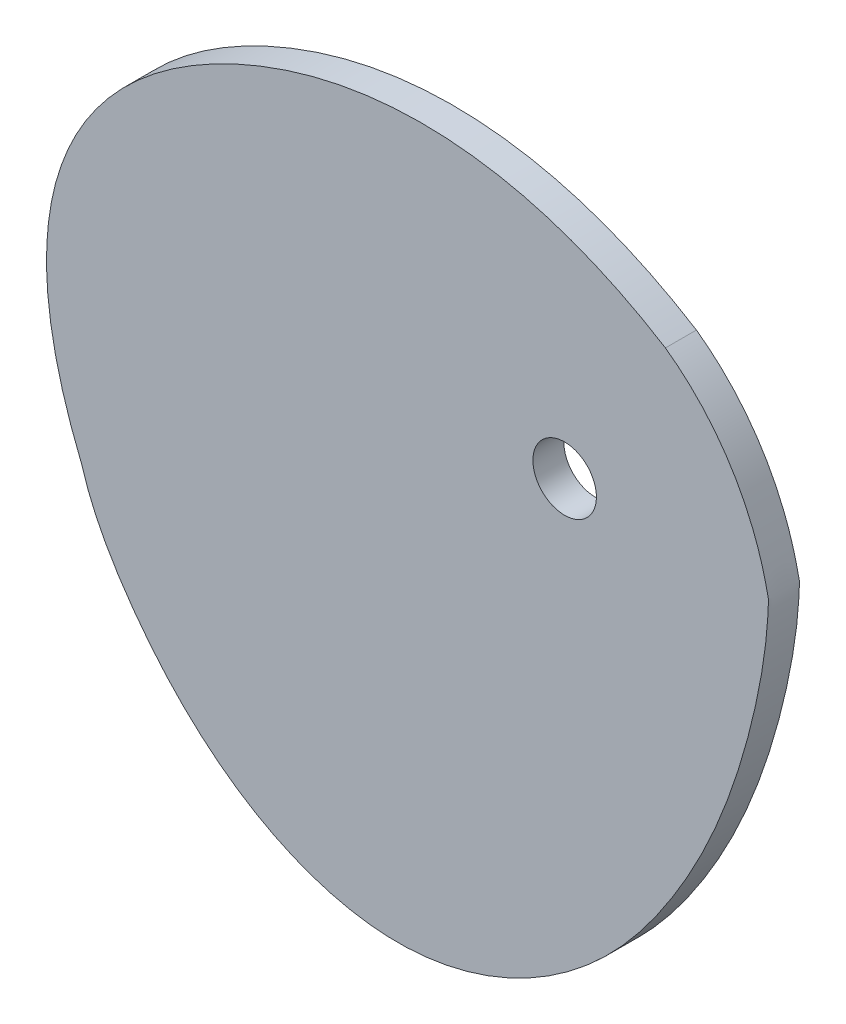
ISO-10303-21;
HEADER;
FILE_DESCRIPTION(('STEP AP214'),'2;1');
FILE_NAME('part.step','',(''),(''),'','','');
FILE_SCHEMA(('AUTOMOTIVE_DESIGN { 1 0 10303 214 1 1 1 1 }'));
ENDSEC;
DATA;
#1=APPLICATION_CONTEXT('core data for automotive mechanical design processes');
#2=APPLICATION_PROTOCOL_DEFINITION('international standard','automotive_design',2000,#1);
#3=PRODUCT_CONTEXT('',#1,'mechanical');
#4=PRODUCT('Part','Part','',(#3));
#5=PRODUCT_RELATED_PRODUCT_CATEGORY('part','',(#4));
#6=PRODUCT_DEFINITION_FORMATION('','',#4);
#7=PRODUCT_DEFINITION_CONTEXT('part definition',#1,'design');
#8=PRODUCT_DEFINITION('design','',#6,#7);
#9=PRODUCT_DEFINITION_SHAPE('','',#8);
#10=(LENGTH_UNIT() NAMED_UNIT(*) SI_UNIT(.MILLI.,.METRE.));
#11=(NAMED_UNIT(*) PLANE_ANGLE_UNIT() SI_UNIT($,.RADIAN.));
#12=(NAMED_UNIT(*) SI_UNIT($,.STERADIAN.) SOLID_ANGLE_UNIT());
#13=UNCERTAINTY_MEASURE_WITH_UNIT(LENGTH_MEASURE(1.E-05),#10,'distance_accuracy_value','');
#14=(GEOMETRIC_REPRESENTATION_CONTEXT(3) GLOBAL_UNCERTAINTY_ASSIGNED_CONTEXT((#13)) GLOBAL_UNIT_ASSIGNED_CONTEXT((#10,
#11,#12)) REPRESENTATION_CONTEXT('',''));
#15=CARTESIAN_POINT('',(0.,0.,0.));
#16=DIRECTION('',(0.,0.,1.));
#17=DIRECTION('',(1.,0.,0.));
#18=AXIS2_PLACEMENT_3D('',#15,#16,#17);
#19=CARTESIAN_POINT('',(2.83016154706759,-39.1014845749319,1.5));
#20=DIRECTION('',(0.,0.,-1.));
#21=DIRECTION('',(-1.,0.,0.));
#22=AXIS2_PLACEMENT_3D('',#19,#20,#21);
#23=PLANE('',#22);
#24=CARTESIAN_POINT('',(-46.7200267733043,-22.204755219371,1.5));
#25=CARTESIAN_POINT('',(-46.6806896431284,-22.339756210772,1.5));
#26=CARTESIAN_POINT('',(-46.5523371878223,-22.7653201294335,1.5));
#27=CARTESIAN_POINT('',(-46.3155303346492,-23.4752196796211,1.5));
#28=CARTESIAN_POINT('',(-45.9947243960051,-24.3283543042865,1.5));
#29=CARTESIAN_POINT('',(-45.6437430297893,-25.1693811667558,1.5));
#30=CARTESIAN_POINT('',(-45.2646353329962,-25.9982013761393,1.5));
#31=CARTESIAN_POINT('',(-44.8594144038269,-26.8148407470711,1.5));
#32=CARTESIAN_POINT('',(-44.4300522960045,-27.6194476364059,1.5));
#33=CARTESIAN_POINT('',(-43.9784750669762,-28.4122906225906,1.5));
#34=CARTESIAN_POINT('',(-43.5065578480158,-29.1937561132233,1.5));
#35=CARTESIAN_POINT('',(-43.0161202134374,-29.9643455431097,1.5));
#36=CARTESIAN_POINT('',(-42.5089208310377,-30.7246734081901,1.5));
#37=CARTESIAN_POINT('',(-41.9866590298339,-31.4754559945261,1.5));
#38=CARTESIAN_POINT('',(-41.272178341668,-32.4651758723665,1.5));
#39=CARTESIAN_POINT('',(-40.5304955827092,-33.4359119257084,1.5));
#40=CARTESIAN_POINT('',(-39.7606544454638,-34.3852551358346,1.5));
#41=CARTESIAN_POINT('',(-39.1687146070949,-35.0862367763247,1.5));
#42=CARTESIAN_POINT('',(-38.5622378296788,-35.775277911029,1.5));
#43=CARTESIAN_POINT('',(-37.9411016548474,-36.4516616916267,1.5));
#44=CARTESIAN_POINT('',(-37.3052185953797,-37.1146504932271,1.5));
#45=CARTESIAN_POINT('',(-36.654537168951,-37.7634872776314,1.5));
#46=CARTESIAN_POINT('',(-35.9890428699015,-38.3973970131874,1.5));
#47=CARTESIAN_POINT('',(-35.3087590978328,-39.0155881247338,1.5));
#48=CARTESIAN_POINT('',(-34.6137480366145,-39.6172539788969,1.5));
#49=CARTESIAN_POINT('',(-33.9041114842077,-40.201574401452,1.5));
#50=CARTESIAN_POINT('',(-33.1799916319454,-40.7677172257195,1.5));
#51=CARTESIAN_POINT('',(-32.441571792439,-41.3148398703262,1.5));
#52=CARTESIAN_POINT('',(-31.6890770752126,-41.8420909448106,1.5));
#53=CARTESIAN_POINT('',(-30.9227750092429,-42.3486118814808,1.5));
#54=CARTESIAN_POINT('',(-30.1429761116329,-42.8335385919371,1.5));
#55=CARTESIAN_POINT('',(-29.3500344017037,-43.296003146648,1.5));
#56=CARTESIAN_POINT('',(-28.5443478598394,-43.7351354759695,1.5));
#57=CARTESIAN_POINT('',(-27.7263588304788,-44.1500650909847,1.5));
#58=CARTESIAN_POINT('',(-26.8965543686953,-44.5399228225483,1.5));
#59=CARTESIAN_POINT('',(-26.0554665298625,-44.9038425769291,1.5));
#60=CARTESIAN_POINT('',(-25.2036726019509,-45.2409631064121,1.5));
#61=CARTESIAN_POINT('',(-24.3417952800304,-45.5504297934193,1.5));
#62=CARTESIAN_POINT('',(-23.4705027826652,-45.8313964460331,1.5));
#63=CARTESIAN_POINT('',(-22.5905089096368,-46.0830271054362,1.5));
#64=CARTESIAN_POINT('',(-21.7025730415144,-46.3044978560701,1.5));
#65=CARTESIAN_POINT('',(-20.8075000776663,-46.4949986657037,1.5));
#66=CARTESIAN_POINT('',(-19.9061403239913,-46.6537351469297,1.5));
#67=CARTESIAN_POINT('',(-18.999389286865,-46.7799306381342,1.5));
#68=CARTESIAN_POINT('',(-18.0881875342416,-46.872827111094,1.5));
#69=CARTESIAN_POINT('',(-17.1735200212908,-46.9316904735896,1.5));
#70=CARTESIAN_POINT('',(-16.2564171300205,-46.95579945848,1.5));
#71=CARTESIAN_POINT('',(-15.3379622535156,-46.9444960185609,1.5));
#72=CARTESIAN_POINT('',(-14.4194164111454,-46.897014518559,1.5));
#73=CARTESIAN_POINT('',(-13.5021714584145,-46.8138702239532,1.5));
#74=CARTESIAN_POINT('',(-12.5876697193115,-46.6959005050609,1.5));
#75=CARTESIAN_POINT('',(-11.6773484463756,-46.5439280755594,1.5));
#76=CARTESIAN_POINT('',(-10.7725868435563,-46.3588455940353,1.5));
#77=CARTESIAN_POINT('',(-9.87470644315353,-46.1415892508581,1.5));
#78=CARTESIAN_POINT('',(-8.98496902317576,-45.8931426962907,1.5));
#79=CARTESIAN_POINT('',(-8.10457534959719,-45.6145327765504,1.5));
#80=CARTESIAN_POINT('',(-7.2346638064212,-45.3068274140633,1.5));
#81=CARTESIAN_POINT('',(-6.3763091668303,-44.9711328632358,1.5));
#82=CARTESIAN_POINT('',(-5.5305214393265,-44.608591087316,1.5));
#83=CARTESIAN_POINT('',(-4.69824480819538,-44.2203770601003,1.5));
#84=CARTESIAN_POINT('',(-3.88035666457306,-43.8076960486166,1.5));
#85=CARTESIAN_POINT('',(-3.0776667304062,-43.37178086539,1.5));
#86=CARTESIAN_POINT('',(-2.29091627583035,-42.9138890970096,1.5));
#87=CARTESIAN_POINT('',(-1.52077743081287,-42.4353003108935,1.5));
#88=CARTESIAN_POINT('',(-0.767852591678114,-41.9373132434567,1.5));
#89=CARTESIAN_POINT('',(-0.0326739230526381,-41.4212429725426,1.5));
#90=CARTESIAN_POINT('',(0.684297044342781,-40.8884180770757,1.5));
#91=CARTESIAN_POINT('',(1.38266971972998,-40.3401777868555,1.5));
#92=CARTESIAN_POINT('',(2.06212466191325,-39.7778691254187,1.5));
#93=CARTESIAN_POINT('',(2.72241369239813,-39.2028440488736,1.5));
#94=CARTESIAN_POINT('',(3.36335991195214,-38.6164565835916,1.5));
#95=CARTESIAN_POINT('',(3.98485762070806,-38.020059965646,1.5));
#96=CARTESIAN_POINT('',(4.586872141861,-37.4150037847611,1.5));
#97=CARTESIAN_POINT('',(5.16943954966292,-36.8026311358668,1.5));
#98=CARTESIAN_POINT('',(5.73266630049337,-36.1842757799967,1.5));
#99=CARTESIAN_POINT('',(6.27672877336092,-35.5612593210856,1.5));
#100=CARTESIAN_POINT('',(6.80187269890598,-34.9348883873418,1.5));
#101=CARTESIAN_POINT('',(7.30841255661586,-34.3064518712496,1.5));
#102=CARTESIAN_POINT('',(7.79673065185279,-33.677218042469,1.5));
#103=CARTESIAN_POINT('',(8.26727693226581,-33.0484322252843,1.5));
#104=CARTESIAN_POINT('',(8.72056567595092,-32.421312524385,1.5));
#105=CARTESIAN_POINT('',(9.15718317743708,-31.7970527967723,1.5));
#106=CARTESIAN_POINT('',(9.5777589868868,-31.1767933527587,1.5));
#107=CARTESIAN_POINT('',(9.98313875569843,-30.5616036586118,1.5));
#108=CARTESIAN_POINT('',(10.6231886493542,-29.5630834979464,1.5));
#109=CARTESIAN_POINT('',(11.3426803358376,-28.3774334310852,1.5));
#110=CARTESIAN_POINT('',(12.119739061767,-27.0057761937296,1.5));
#111=CARTESIAN_POINT('',(12.7314656691996,-25.8657241240726,1.5));
#112=CARTESIAN_POINT('',(13.2980841825559,-24.7513416832927,1.5));
#113=CARTESIAN_POINT('',(13.8228108285091,-23.6628164014472,1.5));
#114=CARTESIAN_POINT('',(14.3087349678902,-22.6001400263386,1.5));
#115=CARTESIAN_POINT('',(14.8296582699646,-21.3998792688078,1.5));
#116=CARTESIAN_POINT('',(15.3712592546028,-20.0692094499295,1.5));
#117=CARTESIAN_POINT('',(15.9765488862487,-18.4650261382676,1.5));
#118=CARTESIAN_POINT('',(16.5127479022829,-16.9161227755077,1.5));
#119=CARTESIAN_POINT('',(16.9889990250079,-15.4199072684742,1.5));
#120=CARTESIAN_POINT('',(17.3723711766362,-14.1276443238027,1.5));
#121=CARTESIAN_POINT('',(17.6819904604084,-13.0086975132311,1.5));
#122=CARTESIAN_POINT('',(17.9311319137297,-12.0542261205352,1.5));
#123=CARTESIAN_POINT('',(18.1299371945772,-11.2556683894719,1.5));
#124=CARTESIAN_POINT('',(18.3161042194094,-10.4706351131512,1.5));
#125=CARTESIAN_POINT('',(18.4903341603048,-9.69783279676552,1.5));
#126=CARTESIAN_POINT('',(18.6531653511248,-8.93598494781779,1.5));
#127=CARTESIAN_POINT('',(18.8049780391056,-8.18384415660625,1.5));
#128=CARTESIAN_POINT('',(18.9460001721467,-7.4402038132655,1.5));
#129=CARTESIAN_POINT('',(19.0763138608845,-6.7039093056558,1.5));
#130=CARTESIAN_POINT('',(19.1958625401379,-5.97386868347734,1.5));
#131=CARTESIAN_POINT('',(19.3044587766999,-5.24906274769108,1.5));
#132=CARTESIAN_POINT('',(19.4178297820653,-4.4098409416767,1.5));
#133=CARTESIAN_POINT('',(19.5007452350434,-3.69243330539014,1.5));
#134=CARTESIAN_POINT('',(19.5593862987678,-3.09619410738784,1.5));
#135=CARTESIAN_POINT('',(19.5912654879333,-2.73992761476211,1.5));
#136=CARTESIAN_POINT('',(19.6198641079612,-2.3841015002169,1.5));
#137=CARTESIAN_POINT('',(19.645033575195,-2.02865900018924,1.5));
#138=CARTESIAN_POINT('',(19.6668946186842,-1.67352574175937,1.5));
#139=CARTESIAN_POINT('',(19.6845438660083,-1.31872839859245,1.5));
#140=CARTESIAN_POINT('',(19.7008731789679,-0.963953499683479,1.5));
#141=CARTESIAN_POINT('',(19.7046150435928,-0.610191974523897,1.5));
#142=CARTESIAN_POINT('',(19.7375218092732,-0.250741843414967,1.5));
#143=CARTESIAN_POINT('',(19.6409542776031,0.0993515058348664,1.5));
#144=CARTESIAN_POINT('',(19.5735637612747,0.452939857720873,1.5));
#145=CARTESIAN_POINT('',(19.4929853708508,0.803041009068936,1.5));
#146=CARTESIAN_POINT('',(19.4107954229631,1.15063058023641,1.5));
#147=CARTESIAN_POINT('',(19.3239793087413,1.49545032526501,1.5));
#148=CARTESIAN_POINT('',(19.2334010369509,1.8375705156503,1.5));
#149=CARTESIAN_POINT('',(19.076564402052,2.40079796578955,1.5));
#150=CARTESIAN_POINT('',(18.7726190681371,3.3950521847464,1.5));
#151=CARTESIAN_POINT('',(18.3055669341586,4.68691012576585,1.5));
#152=CARTESIAN_POINT('',(17.72821517047,6.03840945781484,1.5));
#153=CARTESIAN_POINT('',(17.1412908397453,7.24029203362605,1.5));
#154=CARTESIAN_POINT('',(16.50091822728,8.39848799108871,1.5));
#155=CARTESIAN_POINT('',(15.8083165474384,9.51249777799579,1.5));
#156=CARTESIAN_POINT('',(15.0644935845586,10.5815610262602,1.5));
#157=CARTESIAN_POINT('',(14.2703075234825,11.6046262406065,1.5));
#158=CARTESIAN_POINT('',(13.4265325648609,12.5803316758525,1.5));
#159=CARTESIAN_POINT('',(12.5339253659798,13.5069949121125,1.5));
#160=CARTESIAN_POINT('',(11.5932917893056,14.3826119902024,1.5));
#161=CARTESIAN_POINT('',(10.6635953636642,15.1565474445866,1.5));
#162=CARTESIAN_POINT('',(10.0381787907559,15.6249748171961,1.5));
#163=CARTESIAN_POINT('',(9.7506524888649,15.8299518881213,1.5));
#164=B_SPLINE_CURVE_WITH_KNOTS('',3,(#24,#25,#26,#27,#28,#29,#30,#31,#32,#33,#34,#35,#36,#37,
#38,#39,#40,#41,#42,#43,#44,#45,#46,#47,#48,#49,#50,#51,#52,#53,#54,#55,#56,#57,#58,#59,#60,#61,
#62,#63,#64,#65,#66,#67,#68,#69,#70,#71,#72,#73,#74,#75,#76,#77,#78,#79,#80,#81,#82,#83,#84,#85,
#86,#87,#88,#89,#90,#91,#92,#93,#94,#95,#96,#97,#98,#99,#100,#101,#102,#103,#104,#105,#106,#107,
#108,#109,#110,#111,#112,#113,#114,#115,#116,#117,#118,#119,#120,#121,#122,#123,#124,#125,#126,
#127,#128,#129,#130,#131,#132,#133,#134,#135,#136,#137,#138,#139,#140,#141,#142,#143,#144,#145,
#146,#147,#148,#149,#150,#151,#152,#153,#154,#155,#156,#157,#158,#159,#160,#161,#162,#163),
.UNSPECIFIED.,.F.,.F.,(4,1,1,1,1,1,1,1,1,1,1,1,1,1,1,1,1,1,1,1,1,1,1,1,1,1,1,1,1,1,1,1,1,1,1,1,
1,1,1,1,1,1,1,1,1,1,1,1,1,1,1,1,1,1,1,1,1,1,1,1,1,1,1,1,1,1,1,1,1,1,1,1,1,1,1,1,1,1,1,1,1,1,1,1,
1,1,1,1,1,1,1,1,1,1,1,1,1,1,1,1,1,1,1,1,1,1,1,1,1,1,1,1,1,1,1,1,1,1,1,1,1,1,1,1,1,1,1,1,1,1,1,1,
1,1,1,1,1,4),(0.483675046873344,0.48572747967474,0.490162692570574,0.494596120850626,
0.499029125542321,0.503462729771966,0.507897674169671,0.512334472379887,0.516773466441591,
0.521214881902109,0.525658882604184,0.530105625137013,0.53455531296895,0.539008152916846,
0.547922899701876,0.552384416639101,0.556848379263364,0.561314514709037,0.565782527567126,
0.570252104668917,0.57472291987726,0.579194638894886,0.583666924099619,0.588139439416691,
0.592611855238536,0.597083853402432,0.601555132236205,0.606025411681864,0.610494438506485,
0.614961991608931,0.619427887429995,0.623891985472355,0.628354193935213,0.632814475466727,
0.637272853035195,0.641729415917556,0.646184325800905,0.650637822989553,0.655090232706571,
0.659541971474758,0.663993553557616,0.668445597436172,0.672898832292425,0.677354104464873,
0.6818123838361,0.686274770106807,0.690742498905239,0.695216754459362,0.699697324974414,
0.704183212682017,0.708673273659155,0.7131662319308,0.717660689763857,0.722155137343837,
0.726647961862329,0.731137456047538,0.735621826173181,0.740099199583222,0.744567631771418,
0.749025113055694,0.753469574888048,0.757898895841225,0.76231090731386,0.766703398996338,
0.771074124140268,0.775420804675432,0.779741136219337,0.784032793026208,0.788293432924513,
0.792520702295008,0.796712241144912,0.800865688338389,0.804978687049038,0.809048890506943,
0.813073968120973,0.817051612066944,0.820979544444003,0.824855525115645,0.828677360368422,
0.832442912540997,0.836150110799296,0.839796963260422,0.843381676299789,0.846904129843305,
0.857109335382751,0.863622561031699,0.869914329655403,0.875993807495379,0.881870128005402,
0.88755239179538,0.893049665162577,0.900968457418533,0.908521612405097,0.918075537746338,
0.924891610650607,0.931440482673757,0.937750474589196,0.941838034011192,0.945839551366913,
0.949762689025629,0.953614851422904,0.957403158952581,0.961134423183514,0.96481512410193,
0.968451390015596,0.972048980655687,0.975613273884102,0.979149256268776,0.984410078333624,
0.986154249584476,0.987894493490927,0.989631247743111,0.99136492587983,0.993095917593301,
0.994824589077076,0.99655128341379,0.998276320999325,1.,1.00176420338918,1.00351949178347,
1.0052660957307,1.0070042441421,1.0087341642592,1.01045608162048,1.01217022002793,
1.01726817279731,1.02562954169016,1.03221207066273,1.03871387458968,1.04514728547405,
1.05152405008419,1.05785530678872,1.06415156687227,1.07042270069822,1.07667792887127,
1.08292581834711,1.08917428325383,1.09432862366354),.UNSPECIFIED.);
#165=CARTESIAN_POINT('',(-46.7200267733043,-22.2047552193709,1.5));
#166=VERTEX_POINT('',#165);
#167=CARTESIAN_POINT('',(9.7506524888649,15.8299518881213,1.5));
#168=VERTEX_POINT('',#167);
#169=EDGE_CURVE('E65',#166,#168,#164,.T.);
#170=ORIENTED_EDGE('',*,*,#169,.T.);
#171=CARTESIAN_POINT('',(9.7506524888649,15.8299518881213,1.5));
#172=CARTESIAN_POINT('',(-3.42629180191354,24.0431137556407,1.5));
#173=CARTESIAN_POINT('',(-32.2757957778024,25.879881467022,1.5));
#174=CARTESIAN_POINT('',(-56.2584506985553,0.901227349178821,1.5));
#175=CARTESIAN_POINT('',(-46.7200267733043,-22.2047552193709,1.5));
#176=B_SPLINE_CURVE_WITH_KNOTS('',3,(#171,#172,#173,#174,#175),.UNSPECIFIED.,.F.,.F.,(4,1,4),
(0.,0.496755955770889,0.999855604169913),.UNSPECIFIED.);
#177=EDGE_CURVE('E50',#168,#166,#176,.T.);
#178=ORIENTED_EDGE('',*,*,#177,.T.);
#179=EDGE_LOOP('',(#170,#178));
#180=FACE_BOUND('',#179,.T.);
#181=CARTESIAN_POINT('',(0.,0.,1.5));
#182=DIRECTION('',(0.,0.,1.));
#183=DIRECTION('',(1.,0.,0.));
#184=AXIS2_PLACEMENT_3D('',#181,#182,#183);
#185=CIRCLE('',#184,3.075);
#186=CARTESIAN_POINT('',(3.075,0.,1.5));
#187=VERTEX_POINT('',#186);
#188=EDGE_CURVE('E71',#187,#187,#185,.T.);
#189=ORIENTED_EDGE('',*,*,#188,.F.);
#190=EDGE_LOOP('',(#189));
#191=FACE_BOUND('',#190,.T.);
#192=ADVANCED_FACE('F33',(#180,#191),#23,.F.);
#193=CARTESIAN_POINT('',(2.83016154706759,-39.1014845749319,-1.5));
#194=DIRECTION('',(0.,0.,-1.));
#195=DIRECTION('',(-1.,0.,0.));
#196=AXIS2_PLACEMENT_3D('',#193,#194,#195);
#197=PLANE('',#196);
#198=CARTESIAN_POINT('',(-46.7200267733043,-22.204755219371,-1.5));
#199=CARTESIAN_POINT('',(-46.6806896431284,-22.339756210772,-1.5));
#200=CARTESIAN_POINT('',(-46.5523371878223,-22.7653201294335,-1.5));
#201=CARTESIAN_POINT('',(-46.3155303346492,-23.4752196796211,-1.5));
#202=CARTESIAN_POINT('',(-45.9947243960051,-24.3283543042865,-1.5));
#203=CARTESIAN_POINT('',(-45.6437430297893,-25.1693811667558,-1.5));
#204=CARTESIAN_POINT('',(-45.2646353329962,-25.9982013761393,-1.5));
#205=CARTESIAN_POINT('',(-44.8594144038269,-26.8148407470711,-1.5));
#206=CARTESIAN_POINT('',(-44.4300522960045,-27.6194476364059,-1.5));
#207=CARTESIAN_POINT('',(-43.9784750669762,-28.4122906225906,-1.5));
#208=CARTESIAN_POINT('',(-43.5065578480158,-29.1937561132233,-1.5));
#209=CARTESIAN_POINT('',(-43.0161202134374,-29.9643455431097,-1.5));
#210=CARTESIAN_POINT('',(-42.5089208310377,-30.7246734081901,-1.5));
#211=CARTESIAN_POINT('',(-41.9866590298339,-31.4754559945261,-1.5));
#212=CARTESIAN_POINT('',(-41.272178341668,-32.4651758723665,-1.5));
#213=CARTESIAN_POINT('',(-40.5304955827092,-33.4359119257084,-1.5));
#214=CARTESIAN_POINT('',(-39.7606544454638,-34.3852551358346,-1.5));
#215=CARTESIAN_POINT('',(-39.1687146070949,-35.0862367763247,-1.5));
#216=CARTESIAN_POINT('',(-38.5622378296788,-35.775277911029,-1.5));
#217=CARTESIAN_POINT('',(-37.9411016548474,-36.4516616916267,-1.5));
#218=CARTESIAN_POINT('',(-37.3052185953797,-37.1146504932271,-1.5));
#219=CARTESIAN_POINT('',(-36.654537168951,-37.7634872776314,-1.5));
#220=CARTESIAN_POINT('',(-35.9890428699015,-38.3973970131874,-1.5));
#221=CARTESIAN_POINT('',(-35.3087590978328,-39.0155881247338,-1.5));
#222=CARTESIAN_POINT('',(-34.6137480366145,-39.6172539788969,-1.5));
#223=CARTESIAN_POINT('',(-33.9041114842077,-40.201574401452,-1.5));
#224=CARTESIAN_POINT('',(-33.1799916319454,-40.7677172257195,-1.5));
#225=CARTESIAN_POINT('',(-32.441571792439,-41.3148398703262,-1.5));
#226=CARTESIAN_POINT('',(-31.6890770752126,-41.8420909448106,-1.5));
#227=CARTESIAN_POINT('',(-30.9227750092429,-42.3486118814808,-1.5));
#228=CARTESIAN_POINT('',(-30.1429761116329,-42.8335385919371,-1.5));
#229=CARTESIAN_POINT('',(-29.3500344017037,-43.296003146648,-1.5));
#230=CARTESIAN_POINT('',(-28.5443478598394,-43.7351354759695,-1.5));
#231=CARTESIAN_POINT('',(-27.7263588304788,-44.1500650909847,-1.5));
#232=CARTESIAN_POINT('',(-26.8965543686953,-44.5399228225483,-1.5));
#233=CARTESIAN_POINT('',(-26.0554665298625,-44.9038425769291,-1.5));
#234=CARTESIAN_POINT('',(-25.2036726019509,-45.2409631064121,-1.5));
#235=CARTESIAN_POINT('',(-24.3417952800304,-45.5504297934193,-1.5));
#236=CARTESIAN_POINT('',(-23.4705027826652,-45.8313964460331,-1.5));
#237=CARTESIAN_POINT('',(-22.5905089096368,-46.0830271054362,-1.5));
#238=CARTESIAN_POINT('',(-21.7025730415144,-46.3044978560701,-1.5));
#239=CARTESIAN_POINT('',(-20.8075000776663,-46.4949986657037,-1.5));
#240=CARTESIAN_POINT('',(-19.9061403239913,-46.6537351469297,-1.5));
#241=CARTESIAN_POINT('',(-18.999389286865,-46.7799306381342,-1.5));
#242=CARTESIAN_POINT('',(-18.0881875342416,-46.872827111094,-1.5));
#243=CARTESIAN_POINT('',(-17.1735200212908,-46.9316904735896,-1.5));
#244=CARTESIAN_POINT('',(-16.2564171300205,-46.95579945848,-1.5));
#245=CARTESIAN_POINT('',(-15.3379622535156,-46.9444960185609,-1.5));
#246=CARTESIAN_POINT('',(-14.4194164111454,-46.897014518559,-1.5));
#247=CARTESIAN_POINT('',(-13.5021714584145,-46.8138702239532,-1.5));
#248=CARTESIAN_POINT('',(-12.5876697193115,-46.6959005050609,-1.5));
#249=CARTESIAN_POINT('',(-11.6773484463756,-46.5439280755594,-1.5));
#250=CARTESIAN_POINT('',(-10.7725868435563,-46.3588455940353,-1.5));
#251=CARTESIAN_POINT('',(-9.87470644315353,-46.1415892508581,-1.5));
#252=CARTESIAN_POINT('',(-8.98496902317576,-45.8931426962907,-1.5));
#253=CARTESIAN_POINT('',(-8.10457534959719,-45.6145327765504,-1.5));
#254=CARTESIAN_POINT('',(-7.2346638064212,-45.3068274140633,-1.5));
#255=CARTESIAN_POINT('',(-6.3763091668303,-44.9711328632358,-1.5));
#256=CARTESIAN_POINT('',(-5.5305214393265,-44.608591087316,-1.5));
#257=CARTESIAN_POINT('',(-4.69824480819538,-44.2203770601003,-1.5));
#258=CARTESIAN_POINT('',(-3.88035666457306,-43.8076960486166,-1.5));
#259=CARTESIAN_POINT('',(-3.0776667304062,-43.37178086539,-1.5));
#260=CARTESIAN_POINT('',(-2.29091627583035,-42.9138890970096,-1.5));
#261=CARTESIAN_POINT('',(-1.52077743081287,-42.4353003108935,-1.5));
#262=CARTESIAN_POINT('',(-0.767852591678114,-41.9373132434567,-1.5));
#263=CARTESIAN_POINT('',(-0.0326739230526381,-41.4212429725426,-1.5));
#264=CARTESIAN_POINT('',(0.684297044342781,-40.8884180770757,-1.5));
#265=CARTESIAN_POINT('',(1.38266971972998,-40.3401777868555,-1.5));
#266=CARTESIAN_POINT('',(2.06212466191325,-39.7778691254187,-1.5));
#267=CARTESIAN_POINT('',(2.72241369239813,-39.2028440488736,-1.5));
#268=CARTESIAN_POINT('',(3.36335991195214,-38.6164565835916,-1.5));
#269=CARTESIAN_POINT('',(3.98485762070806,-38.020059965646,-1.5));
#270=CARTESIAN_POINT('',(4.586872141861,-37.4150037847611,-1.5));
#271=CARTESIAN_POINT('',(5.16943954966292,-36.8026311358668,-1.5));
#272=CARTESIAN_POINT('',(5.73266630049337,-36.1842757799967,-1.5));
#273=CARTESIAN_POINT('',(6.27672877336092,-35.5612593210856,-1.5));
#274=CARTESIAN_POINT('',(6.80187269890598,-34.9348883873418,-1.5));
#275=CARTESIAN_POINT('',(7.30841255661586,-34.3064518712496,-1.5));
#276=CARTESIAN_POINT('',(7.79673065185279,-33.677218042469,-1.5));
#277=CARTESIAN_POINT('',(8.26727693226581,-33.0484322252843,-1.5));
#278=CARTESIAN_POINT('',(8.72056567595092,-32.421312524385,-1.5));
#279=CARTESIAN_POINT('',(9.15718317743708,-31.7970527967723,-1.5));
#280=CARTESIAN_POINT('',(9.5777589868868,-31.1767933527587,-1.5));
#281=CARTESIAN_POINT('',(9.98313875569843,-30.5616036586118,-1.5));
#282=CARTESIAN_POINT('',(10.6231886493542,-29.5630834979464,-1.5));
#283=CARTESIAN_POINT('',(11.3426803358376,-28.3774334310852,-1.5));
#284=CARTESIAN_POINT('',(12.119739061767,-27.0057761937296,-1.5));
#285=CARTESIAN_POINT('',(12.7314656691996,-25.8657241240726,-1.5));
#286=CARTESIAN_POINT('',(13.2980841825559,-24.7513416832927,-1.5));
#287=CARTESIAN_POINT('',(13.8228108285091,-23.6628164014472,-1.5));
#288=CARTESIAN_POINT('',(14.3087349678902,-22.6001400263386,-1.5));
#289=CARTESIAN_POINT('',(14.8296582699646,-21.3998792688078,-1.5));
#290=CARTESIAN_POINT('',(15.3712592546028,-20.0692094499295,-1.5));
#291=CARTESIAN_POINT('',(15.9765488862487,-18.4650261382676,-1.5));
#292=CARTESIAN_POINT('',(16.5127479022829,-16.9161227755077,-1.5));
#293=CARTESIAN_POINT('',(16.9889990250079,-15.4199072684742,-1.5));
#294=CARTESIAN_POINT('',(17.3723711766362,-14.1276443238027,-1.5));
#295=CARTESIAN_POINT('',(17.6819904604084,-13.0086975132311,-1.5));
#296=CARTESIAN_POINT('',(17.9311319137297,-12.0542261205352,-1.5));
#297=CARTESIAN_POINT('',(18.1299371945772,-11.2556683894719,-1.5));
#298=CARTESIAN_POINT('',(18.3161042194094,-10.4706351131512,-1.5));
#299=CARTESIAN_POINT('',(18.4903341603048,-9.69783279676552,-1.5));
#300=CARTESIAN_POINT('',(18.6531653511248,-8.93598494781779,-1.5));
#301=CARTESIAN_POINT('',(18.8049780391056,-8.18384415660625,-1.5));
#302=CARTESIAN_POINT('',(18.9460001721467,-7.4402038132655,-1.5));
#303=CARTESIAN_POINT('',(19.0763138608845,-6.7039093056558,-1.5));
#304=CARTESIAN_POINT('',(19.1958625401379,-5.97386868347734,-1.5));
#305=CARTESIAN_POINT('',(19.3044587766999,-5.24906274769108,-1.5));
#306=CARTESIAN_POINT('',(19.4178297820653,-4.4098409416767,-1.5));
#307=CARTESIAN_POINT('',(19.5007452350434,-3.69243330539014,-1.5));
#308=CARTESIAN_POINT('',(19.5593862987678,-3.09619410738784,-1.5));
#309=CARTESIAN_POINT('',(19.5912654879333,-2.73992761476211,-1.5));
#310=CARTESIAN_POINT('',(19.6198641079612,-2.3841015002169,-1.5));
#311=CARTESIAN_POINT('',(19.645033575195,-2.02865900018924,-1.5));
#312=CARTESIAN_POINT('',(19.6668946186842,-1.67352574175937,-1.5));
#313=CARTESIAN_POINT('',(19.6845438660083,-1.31872839859245,-1.5));
#314=CARTESIAN_POINT('',(19.7008731789679,-0.963953499683479,-1.5));
#315=CARTESIAN_POINT('',(19.7046150435928,-0.610191974523897,-1.5));
#316=CARTESIAN_POINT('',(19.7375218092732,-0.250741843414967,-1.5));
#317=CARTESIAN_POINT('',(19.6409542776031,0.0993515058348664,-1.5));
#318=CARTESIAN_POINT('',(19.5735637612747,0.452939857720873,-1.5));
#319=CARTESIAN_POINT('',(19.4929853708508,0.803041009068936,-1.5));
#320=CARTESIAN_POINT('',(19.4107954229631,1.15063058023641,-1.5));
#321=CARTESIAN_POINT('',(19.3239793087413,1.49545032526501,-1.5));
#322=CARTESIAN_POINT('',(19.2334010369509,1.8375705156503,-1.5));
#323=CARTESIAN_POINT('',(19.076564402052,2.40079796578955,-1.5));
#324=CARTESIAN_POINT('',(18.7726190681371,3.3950521847464,-1.5));
#325=CARTESIAN_POINT('',(18.3055669341586,4.68691012576585,-1.5));
#326=CARTESIAN_POINT('',(17.72821517047,6.03840945781484,-1.5));
#327=CARTESIAN_POINT('',(17.1412908397453,7.24029203362605,-1.5));
#328=CARTESIAN_POINT('',(16.50091822728,8.39848799108871,-1.5));
#329=CARTESIAN_POINT('',(15.8083165474384,9.51249777799579,-1.5));
#330=CARTESIAN_POINT('',(15.0644935845586,10.5815610262602,-1.5));
#331=CARTESIAN_POINT('',(14.2703075234825,11.6046262406065,-1.5));
#332=CARTESIAN_POINT('',(13.4265325648609,12.5803316758525,-1.5));
#333=CARTESIAN_POINT('',(12.5339253659798,13.5069949121125,-1.5));
#334=CARTESIAN_POINT('',(11.5932917893056,14.3826119902024,-1.5));
#335=CARTESIAN_POINT('',(10.6635953636642,15.1565474445866,-1.5));
#336=CARTESIAN_POINT('',(10.0381787907559,15.6249748171961,-1.5));
#337=CARTESIAN_POINT('',(9.7506524888649,15.8299518881213,-1.5));
#338=B_SPLINE_CURVE_WITH_KNOTS('',3,(#198,#199,#200,#201,#202,#203,#204,#205,#206,#207,#208,
#209,#210,#211,#212,#213,#214,#215,#216,#217,#218,#219,#220,#221,#222,#223,#224,#225,#226,#227,
#228,#229,#230,#231,#232,#233,#234,#235,#236,#237,#238,#239,#240,#241,#242,#243,#244,#245,#246,
#247,#248,#249,#250,#251,#252,#253,#254,#255,#256,#257,#258,#259,#260,#261,#262,#263,#264,#265,
#266,#267,#268,#269,#270,#271,#272,#273,#274,#275,#276,#277,#278,#279,#280,#281,#282,#283,#284,
#285,#286,#287,#288,#289,#290,#291,#292,#293,#294,#295,#296,#297,#298,#299,#300,#301,#302,#303,
#304,#305,#306,#307,#308,#309,#310,#311,#312,#313,#314,#315,#316,#317,#318,#319,#320,#321,#322,
#323,#324,#325,#326,#327,#328,#329,#330,#331,#332,#333,#334,#335,#336,#337),.UNSPECIFIED.,.F.,
.F.,(4,1,1,1,1,1,1,1,1,1,1,1,1,1,1,1,1,1,1,1,1,1,1,1,1,1,1,1,1,1,1,1,1,1,1,1,1,1,1,1,1,1,1,1,1,
1,1,1,1,1,1,1,1,1,1,1,1,1,1,1,1,1,1,1,1,1,1,1,1,1,1,1,1,1,1,1,1,1,1,1,1,1,1,1,1,1,1,1,1,1,1,1,1,
1,1,1,1,1,1,1,1,1,1,1,1,1,1,1,1,1,1,1,1,1,1,1,1,1,1,1,1,1,1,1,1,1,1,1,1,1,1,1,1,1,1,1,1,4),
(0.483675046873344,0.48572747967474,0.490162692570574,0.494596120850626,0.499029125542321,
0.503462729771966,0.507897674169671,0.512334472379887,0.516773466441591,0.521214881902109,
0.525658882604184,0.530105625137013,0.53455531296895,0.539008152916846,0.547922899701876,
0.552384416639101,0.556848379263364,0.561314514709037,0.565782527567126,0.570252104668917,
0.57472291987726,0.579194638894886,0.583666924099619,0.588139439416691,0.592611855238536,
0.597083853402432,0.601555132236205,0.606025411681864,0.610494438506485,0.614961991608931,
0.619427887429995,0.623891985472355,0.628354193935213,0.632814475466727,0.637272853035195,
0.641729415917556,0.646184325800905,0.650637822989553,0.655090232706571,0.659541971474758,
0.663993553557616,0.668445597436172,0.672898832292425,0.677354104464873,0.6818123838361,
0.686274770106807,0.690742498905239,0.695216754459362,0.699697324974414,0.704183212682017,
0.708673273659155,0.7131662319308,0.717660689763857,0.722155137343837,0.726647961862329,
0.731137456047538,0.735621826173181,0.740099199583222,0.744567631771418,0.749025113055694,
0.753469574888048,0.757898895841225,0.76231090731386,0.766703398996338,0.771074124140268,
0.775420804675432,0.779741136219337,0.784032793026208,0.788293432924513,0.792520702295008,
0.796712241144912,0.800865688338389,0.804978687049038,0.809048890506943,0.813073968120973,
0.817051612066944,0.820979544444003,0.824855525115645,0.828677360368422,0.832442912540997,
0.836150110799296,0.839796963260422,0.843381676299789,0.846904129843305,0.857109335382751,
0.863622561031699,0.869914329655403,0.875993807495379,0.881870128005402,0.88755239179538,
0.893049665162577,0.900968457418533,0.908521612405097,0.918075537746338,0.924891610650607,
0.931440482673757,0.937750474589196,0.941838034011192,0.945839551366913,0.949762689025629,
0.953614851422904,0.957403158952581,0.961134423183514,0.96481512410193,0.968451390015596,
0.972048980655687,0.975613273884102,0.979149256268776,0.984410078333624,0.986154249584476,
0.987894493490927,0.989631247743111,0.99136492587983,0.993095917593301,0.994824589077076,
0.99655128341379,0.998276320999325,1.,1.00176420338918,1.00351949178347,1.0052660957307,
1.0070042441421,1.0087341642592,1.01045608162048,1.01217022002793,1.01726817279731,
1.02562954169016,1.03221207066273,1.03871387458968,1.04514728547405,1.05152405008419,
1.05785530678872,1.06415156687227,1.07042270069822,1.07667792887127,1.08292581834711,
1.08917428325383,1.09432862366354),.UNSPECIFIED.);
#339=CARTESIAN_POINT('',(-46.7200267733043,-22.2047552193709,-1.5));
#340=VERTEX_POINT('',#339);
#341=CARTESIAN_POINT('',(9.7506524888649,15.8299518881213,-1.5));
#342=VERTEX_POINT('',#341);
#343=EDGE_CURVE('E66',#340,#342,#338,.T.);
#344=ORIENTED_EDGE('',*,*,#343,.F.);
#345=CARTESIAN_POINT('',(9.7506524888649,15.8299518881213,-1.5));
#346=CARTESIAN_POINT('',(-3.42629180191354,24.0431137556407,-1.5));
#347=CARTESIAN_POINT('',(-32.2757957778024,25.879881467022,-1.5));
#348=CARTESIAN_POINT('',(-56.2584506985553,0.901227349178821,-1.5));
#349=CARTESIAN_POINT('',(-46.7200267733043,-22.2047552193709,-1.5));
#350=B_SPLINE_CURVE_WITH_KNOTS('',3,(#345,#346,#347,#348,#349),.UNSPECIFIED.,.F.,.F.,(4,1,4),
(0.,0.496755955770889,0.999855604169913),.UNSPECIFIED.);
#351=EDGE_CURVE('E58',#342,#340,#350,.T.);
#352=ORIENTED_EDGE('',*,*,#351,.F.);
#353=EDGE_LOOP('',(#344,#352));
#354=FACE_BOUND('',#353,.T.);
#355=CARTESIAN_POINT('',(0.,0.,-1.5));
#356=DIRECTION('',(0.,0.,1.));
#357=DIRECTION('',(1.,0.,0.));
#358=AXIS2_PLACEMENT_3D('',#355,#356,#357);
#359=CIRCLE('',#358,3.075);
#360=CARTESIAN_POINT('',(3.075,0.,-1.5));
#361=VERTEX_POINT('',#360);
#362=EDGE_CURVE('E74',#361,#361,#359,.T.);
#363=ORIENTED_EDGE('',*,*,#362,.T.);
#364=EDGE_LOOP('',(#363));
#365=FACE_BOUND('',#364,.T.);
#366=ADVANCED_FACE('F69',(#354,#365),#197,.T.);
#367=DIRECTION('',(0.,0.,-1.));
#368=VECTOR('',#367,1.);
#369=SURFACE_OF_LINEAR_EXTRUSION('',#164,#368);
#370=ORIENTED_EDGE('',*,*,#343,.T.);
#371=DIRECTION('',(0.,0.,-1.));
#372=VECTOR('',#371,1.);
#373=CARTESIAN_POINT('',(9.7506524888649,15.8299518881213,1.5));
#374=LINE('',#373,#372);
#375=EDGE_CURVE('E11',#168,#342,#374,.T.);
#376=ORIENTED_EDGE('',*,*,#375,.F.);
#377=ORIENTED_EDGE('',*,*,#169,.F.);
#378=DIRECTION('',(0.,0.,-1.));
#379=VECTOR('',#378,1.);
#380=CARTESIAN_POINT('',(-46.7200267733043,-22.2047552193709,1.5));
#381=LINE('',#380,#379);
#382=EDGE_CURVE('E43',#166,#340,#381,.T.);
#383=ORIENTED_EDGE('',*,*,#382,.T.);
#384=EDGE_LOOP('',(#370,#376,#377,#383));
#385=FACE_BOUND('',#384,.T.);
#386=ADVANCED_FACE('F35',(#385),#369,.F.);
#387=DIRECTION('',(0.,0.,-1.));
#388=VECTOR('',#387,1.);
#389=SURFACE_OF_LINEAR_EXTRUSION('',#176,#388);
#390=ORIENTED_EDGE('',*,*,#351,.T.);
#391=ORIENTED_EDGE('',*,*,#382,.F.);
#392=ORIENTED_EDGE('',*,*,#177,.F.);
#393=ORIENTED_EDGE('',*,*,#375,.T.);
#394=EDGE_LOOP('',(#390,#391,#392,#393));
#395=FACE_BOUND('',#394,.T.);
#396=ADVANCED_FACE('F61',(#395),#389,.F.);
#397=CARTESIAN_POINT('',(0.,0.,1.5));
#398=DIRECTION('',(0.,0.,-1.));
#399=DIRECTION('',(-1.,0.,0.));
#400=AXIS2_PLACEMENT_3D('',#397,#398,#399);
#401=CYLINDRICAL_SURFACE('',#400,3.075);
#402=ORIENTED_EDGE('',*,*,#188,.T.);
#403=EDGE_LOOP('',(#402));
#404=FACE_BOUND('',#403,.T.);
#405=ORIENTED_EDGE('',*,*,#362,.F.);
#406=EDGE_LOOP('',(#405));
#407=FACE_BOUND('',#406,.T.);
#408=ADVANCED_FACE('F99',(#404,#407),#401,.F.);
#409=CLOSED_SHELL('',(#192,#366,#386,#396,#408));
#410=MANIFOLD_SOLID_BREP('B2',#409);
#411=ADVANCED_BREP_SHAPE_REPRESENTATION('',(#18,#410),#14);
#412=SHAPE_DEFINITION_REPRESENTATION(#9,#411);
ENDSEC;
END-ISO-10303-21;
